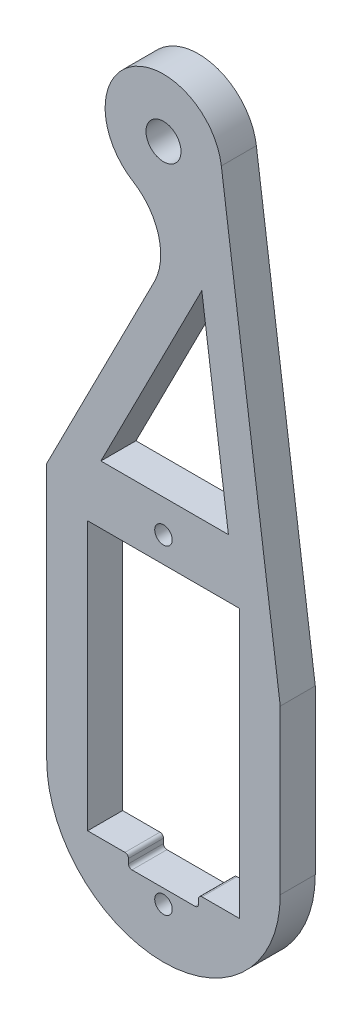
ISO-10303-21;
HEADER;
FILE_DESCRIPTION(('STEP AP214'),'2;1');
FILE_NAME('part.step','',(''),(''),'','','');
FILE_SCHEMA(('AUTOMOTIVE_DESIGN { 1 0 10303 214 1 1 1 1 }'));
ENDSEC;
DATA;
#1=APPLICATION_CONTEXT('core data for automotive mechanical design processes');
#2=APPLICATION_PROTOCOL_DEFINITION('international standard','automotive_design',2000,#1);
#3=PRODUCT_CONTEXT('',#1,'mechanical');
#4=PRODUCT('Part','Part','',(#3));
#5=PRODUCT_RELATED_PRODUCT_CATEGORY('part','',(#4));
#6=PRODUCT_DEFINITION_FORMATION('','',#4);
#7=PRODUCT_DEFINITION_CONTEXT('part definition',#1,'design');
#8=PRODUCT_DEFINITION('design','',#6,#7);
#9=PRODUCT_DEFINITION_SHAPE('','',#8);
#10=(LENGTH_UNIT() NAMED_UNIT(*) SI_UNIT(.MILLI.,.METRE.));
#11=(NAMED_UNIT(*) PLANE_ANGLE_UNIT() SI_UNIT($,.RADIAN.));
#12=(NAMED_UNIT(*) SI_UNIT($,.STERADIAN.) SOLID_ANGLE_UNIT());
#13=UNCERTAINTY_MEASURE_WITH_UNIT(LENGTH_MEASURE(1.E-05),#10,'distance_accuracy_value','');
#14=(GEOMETRIC_REPRESENTATION_CONTEXT(3) GLOBAL_UNCERTAINTY_ASSIGNED_CONTEXT((#13)) GLOBAL_UNIT_ASSIGNED_CONTEXT((#10,
#11,#12)) REPRESENTATION_CONTEXT('',''));
#15=CARTESIAN_POINT('',(0.,0.,0.));
#16=DIRECTION('',(0.,0.,1.));
#17=DIRECTION('',(1.,0.,0.));
#18=AXIS2_PLACEMENT_3D('',#15,#16,#17);
#19=CARTESIAN_POINT('',(0.,-11.5,1.5));
#20=DIRECTION('',(0.,1.,0.));
#21=DIRECTION('',(0.,0.,1.));
#22=AXIS2_PLACEMENT_3D('',#19,#20,#21);
#23=PLANE('',#22);
#24=DIRECTION('',(1.,0.,0.));
#25=VECTOR('',#24,1.);
#26=CARTESIAN_POINT('',(0.,-11.5,-1.5));
#27=LINE('',#26,#25);
#28=CARTESIAN_POINT('',(3.3,-11.5,-1.5));
#29=VERTEX_POINT('',#28);
#30=CARTESIAN_POINT('',(6.5,-11.5,-1.5));
#31=VERTEX_POINT('',#30);
#32=EDGE_CURVE('E315',#29,#31,#27,.T.);
#33=ORIENTED_EDGE('',*,*,#32,.F.);
#34=DIRECTION('',(0.,0.,1.));
#35=VECTOR('',#34,1.);
#36=CARTESIAN_POINT('',(3.3,-11.5,1.5));
#37=LINE('',#36,#35);
#38=CARTESIAN_POINT('',(3.3,-11.5,1.5));
#39=VERTEX_POINT('',#38);
#40=EDGE_CURVE('E398',#29,#39,#37,.T.);
#41=ORIENTED_EDGE('',*,*,#40,.T.);
#42=DIRECTION('',(1.,0.,0.));
#43=VECTOR('',#42,1.);
#44=CARTESIAN_POINT('',(0.,-11.5,1.5));
#45=LINE('',#44,#43);
#46=CARTESIAN_POINT('',(6.5,-11.5,1.5));
#47=VERTEX_POINT('',#46);
#48=EDGE_CURVE('E248',#39,#47,#45,.T.);
#49=ORIENTED_EDGE('',*,*,#48,.T.);
#50=DIRECTION('',(0.,0.,-1.));
#51=VECTOR('',#50,1.);
#52=CARTESIAN_POINT('',(6.5,-11.5,1.5));
#53=LINE('',#52,#51);
#54=EDGE_CURVE('E359',#47,#31,#53,.T.);
#55=ORIENTED_EDGE('',*,*,#54,.T.);
#56=EDGE_LOOP('',(#33,#41,#49,#55));
#57=FACE_BOUND('',#56,.T.);
#58=ADVANCED_FACE('F41',(#57),#23,.T.);
#59=CARTESIAN_POINT('',(0.,16.5,1.5));
#60=DIRECTION('',(0.,1.,0.));
#61=DIRECTION('',(0.,0.,1.));
#62=AXIS2_PLACEMENT_3D('',#59,#60,#61);
#63=PLANE('',#62);
#64=DIRECTION('',(1.,0.,0.));
#65=VECTOR('',#64,1.);
#66=CARTESIAN_POINT('',(0.,16.5,-1.5));
#67=LINE('',#66,#65);
#68=CARTESIAN_POINT('',(-5.35920766336086,16.5,-1.5));
#69=VERTEX_POINT('',#68);
#70=CARTESIAN_POINT('',(5.56229891618006,16.5,-1.5));
#71=VERTEX_POINT('',#70);
#72=EDGE_CURVE('E323',#69,#71,#67,.T.);
#73=ORIENTED_EDGE('',*,*,#72,.F.);
#74=DIRECTION('',(0.,0.,-1.));
#75=VECTOR('',#74,1.);
#76=CARTESIAN_POINT('',(-5.35920766336086,16.5,1.5));
#77=LINE('',#76,#75);
#78=CARTESIAN_POINT('',(-5.35920766336086,16.5,1.5));
#79=VERTEX_POINT('',#78);
#80=EDGE_CURVE('E350',#79,#69,#77,.T.);
#81=ORIENTED_EDGE('',*,*,#80,.F.);
#82=DIRECTION('',(1.,0.,0.));
#83=VECTOR('',#82,1.);
#84=CARTESIAN_POINT('',(0.,16.5,1.5));
#85=LINE('',#84,#83);
#86=CARTESIAN_POINT('',(5.56229891618006,16.5,1.5));
#87=VERTEX_POINT('',#86);
#88=EDGE_CURVE('E257',#79,#87,#85,.T.);
#89=ORIENTED_EDGE('',*,*,#88,.T.);
#90=DIRECTION('',(0.,0.,-1.));
#91=VECTOR('',#90,1.);
#92=CARTESIAN_POINT('',(5.56229891618006,16.5,1.5));
#93=LINE('',#92,#91);
#94=EDGE_CURVE('E343',#87,#71,#93,.T.);
#95=ORIENTED_EDGE('',*,*,#94,.T.);
#96=EDGE_LOOP('',(#73,#81,#89,#95));
#97=FACE_BOUND('',#96,.T.);
#98=ADVANCED_FACE('F487',(#97),#63,.T.);
#99=CARTESIAN_POINT('',(-10.9290256495219,5.56861670660875,1.5));
#100=DIRECTION('',(-0.891006524188369,0.453990499739544,0.));
#101=DIRECTION('',(-0.453990499739545,-0.891006524188369,0.));
#102=AXIS2_PLACEMENT_3D('',#99,#100,#101);
#103=PLANE('',#102);
#104=DIRECTION('',(0.453990499739544,0.891006524188369,0.));
#105=VECTOR('',#104,1.);
#106=CARTESIAN_POINT('',(-10.9290256495219,5.56861670660875,-1.5));
#107=LINE('',#106,#105);
#108=CARTESIAN_POINT('',(3.28334616685816,33.4619669415817,-1.5));
#109=VERTEX_POINT('',#108);
#110=EDGE_CURVE('E327',#69,#109,#107,.T.);
#111=ORIENTED_EDGE('',*,*,#110,.T.);
#112=DIRECTION('',(0.,0.,-1.));
#113=VECTOR('',#112,1.);
#114=CARTESIAN_POINT('',(3.28334616685816,33.4619669415817,1.5));
#115=LINE('',#114,#113);
#116=CARTESIAN_POINT('',(3.28334616685816,33.4619669415817,1.5));
#117=VERTEX_POINT('',#116);
#118=EDGE_CURVE('E346',#117,#109,#115,.T.);
#119=ORIENTED_EDGE('',*,*,#118,.F.);
#120=DIRECTION('',(0.453990499739544,0.891006524188369,0.));
#121=VECTOR('',#120,1.);
#122=CARTESIAN_POINT('',(-10.9290256495219,5.56861670660875,1.5));
#123=LINE('',#122,#121);
#124=EDGE_CURVE('E261',#79,#117,#123,.T.);
#125=ORIENTED_EDGE('',*,*,#124,.F.);
#126=ORIENTED_EDGE('',*,*,#80,.T.);
#127=EDGE_LOOP('',(#111,#119,#125,#126));
#128=FACE_BOUND('',#127,.T.);
#129=ADVANCED_FACE('F494',(#128),#103,.F.);
#130=CARTESIAN_POINT('',(0.,11.5,1.5));
#131=DIRECTION('',(0.,1.,0.));
#132=DIRECTION('',(0.,0.,1.));
#133=AXIS2_PLACEMENT_3D('',#130,#131,#132);
#134=PLANE('',#133);
#135=DIRECTION('',(1.,0.,0.));
#136=VECTOR('',#135,1.);
#137=CARTESIAN_POINT('',(0.,11.5,-1.5));
#138=LINE('',#137,#136);
#139=CARTESIAN_POINT('',(-6.5,11.5,-1.5));
#140=VERTEX_POINT('',#139);
#141=CARTESIAN_POINT('',(6.5,11.5,-1.5));
#142=VERTEX_POINT('',#141);
#143=EDGE_CURVE('E307',#140,#142,#138,.T.);
#144=ORIENTED_EDGE('',*,*,#143,.T.);
#145=DIRECTION('',(0.,0.,-1.));
#146=VECTOR('',#145,1.);
#147=CARTESIAN_POINT('',(6.5,11.5,1.5));
#148=LINE('',#147,#146);
#149=CARTESIAN_POINT('',(6.5,11.5,1.5));
#150=VERTEX_POINT('',#149);
#151=EDGE_CURVE('E347',#150,#142,#148,.T.);
#152=ORIENTED_EDGE('',*,*,#151,.F.);
#153=DIRECTION('',(1.,0.,0.));
#154=VECTOR('',#153,1.);
#155=CARTESIAN_POINT('',(0.,11.5,1.5));
#156=LINE('',#155,#154);
#157=CARTESIAN_POINT('',(-6.5,11.5,1.5));
#158=VERTEX_POINT('',#157);
#159=EDGE_CURVE('E240',#158,#150,#156,.T.);
#160=ORIENTED_EDGE('',*,*,#159,.F.);
#161=DIRECTION('',(0.,0.,-1.));
#162=VECTOR('',#161,1.);
#163=CARTESIAN_POINT('',(-6.5,11.5,1.5));
#164=LINE('',#163,#162);
#165=EDGE_CURVE('E203',#158,#140,#164,.T.);
#166=ORIENTED_EDGE('',*,*,#165,.T.);
#167=EDGE_LOOP('',(#144,#152,#160,#166));
#168=FACE_BOUND('',#167,.T.);
#169=ADVANCED_FACE('F508',(#168),#134,.F.);
#170=CARTESIAN_POINT('',(6.5,0.,1.5));
#171=DIRECTION('',(1.,0.,0.));
#172=DIRECTION('',(0.,1.,0.));
#173=AXIS2_PLACEMENT_3D('',#170,#171,#172);
#174=PLANE('',#173);
#175=DIRECTION('',(0.,-1.,0.));
#176=VECTOR('',#175,1.);
#177=CARTESIAN_POINT('',(6.5,0.,-1.5));
#178=LINE('',#177,#176);
#179=EDGE_CURVE('E311',#142,#31,#178,.T.);
#180=ORIENTED_EDGE('',*,*,#179,.T.);
#181=ORIENTED_EDGE('',*,*,#54,.F.);
#182=DIRECTION('',(0.,-1.,0.));
#183=VECTOR('',#182,1.);
#184=CARTESIAN_POINT('',(6.5,0.,1.5));
#185=LINE('',#184,#183);
#186=EDGE_CURVE('E244',#150,#47,#185,.T.);
#187=ORIENTED_EDGE('',*,*,#186,.F.);
#188=ORIENTED_EDGE('',*,*,#151,.T.);
#189=EDGE_LOOP('',(#180,#181,#187,#188));
#190=FACE_BOUND('',#189,.T.);
#191=ADVANCED_FACE('F501',(#190),#174,.F.);
#192=CARTESIAN_POINT('',(-6.5,-11.5,1.5));
#193=VERTEX_POINT('',#192);
#194=CARTESIAN_POINT('',(-3.3,-11.5,1.5));
#195=VERTEX_POINT('',#194);
#196=EDGE_CURVE('E249',#193,#195,#45,.T.);
#197=ORIENTED_EDGE('',*,*,#196,.T.);
#198=DIRECTION('',(0.,0.,1.));
#199=VECTOR('',#198,1.);
#200=CARTESIAN_POINT('',(-3.3,-11.5,-1.5));
#201=LINE('',#200,#199);
#202=CARTESIAN_POINT('',(-3.3,-11.5,-1.5));
#203=VERTEX_POINT('',#202);
#204=EDGE_CURVE('E419',#195,#203,#201,.F.);
#205=ORIENTED_EDGE('',*,*,#204,.T.);
#206=CARTESIAN_POINT('',(-6.5,-11.5,-1.5));
#207=VERTEX_POINT('',#206);
#208=EDGE_CURVE('E316',#207,#203,#27,.T.);
#209=ORIENTED_EDGE('',*,*,#208,.F.);
#210=DIRECTION('',(0.,0.,-1.));
#211=VECTOR('',#210,1.);
#212=CARTESIAN_POINT('',(-6.5,-11.5,1.5));
#213=LINE('',#212,#211);
#214=EDGE_CURVE('E356',#193,#207,#213,.T.);
#215=ORIENTED_EDGE('',*,*,#214,.F.);
#216=EDGE_LOOP('',(#197,#205,#209,#215));
#217=FACE_BOUND('',#216,.T.);
#218=ADVANCED_FACE('F490',(#217),#23,.T.);
#219=CARTESIAN_POINT('',(-5.23715044284418,34.361064899941,1.5));
#220=DIRECTION('',(0.,0.,-1.));
#221=DIRECTION('',(-1.,0.,0.));
#222=AXIS2_PLACEMENT_3D('',#219,#220,#221);
#223=CYLINDRICAL_SURFACE('',#222,5.);
#224=CARTESIAN_POINT('',(-5.23715044284418,34.361064899941,-1.5));
#225=DIRECTION('',(0.,0.,1.));
#226=DIRECTION('',(1.,0.,0.));
#227=AXIS2_PLACEMENT_3D('',#224,#225,#226);
#228=CIRCLE('',#227,5.);
#229=CARTESIAN_POINT('',(-0.78211782190234,32.0911124012433,-1.5));
#230=VERTEX_POINT('',#229);
#231=CARTESIAN_POINT('',(-2.61857522142209,38.6205324499705,-1.5));
#232=VERTEX_POINT('',#231);
#233=EDGE_CURVE('E197',#230,#232,#228,.T.);
#234=ORIENTED_EDGE('',*,*,#233,.F.);
#235=DIRECTION('',(0.,0.,-1.));
#236=VECTOR('',#235,1.);
#237=CARTESIAN_POINT('',(-0.78211782190234,32.0911124012433,1.5));
#238=LINE('',#237,#236);
#239=CARTESIAN_POINT('',(-0.78211782190234,32.0911124012433,1.5));
#240=VERTEX_POINT('',#239);
#241=EDGE_CURVE('E192',#240,#230,#238,.T.);
#242=ORIENTED_EDGE('',*,*,#241,.F.);
#243=CARTESIAN_POINT('',(-5.23715044284418,34.361064899941,1.5));
#244=DIRECTION('',(0.,0.,1.));
#245=DIRECTION('',(1.,0.,0.));
#246=AXIS2_PLACEMENT_3D('',#243,#244,#245);
#247=CIRCLE('',#246,5.);
#248=CARTESIAN_POINT('',(-2.61857522142209,38.6205324499705,1.5));
#249=VERTEX_POINT('',#248);
#250=EDGE_CURVE('E195',#240,#249,#247,.T.);
#251=ORIENTED_EDGE('',*,*,#250,.T.);
#252=DIRECTION('',(0.,0.,-1.));
#253=VECTOR('',#252,1.);
#254=CARTESIAN_POINT('',(-2.61857522142209,38.6205324499705,1.5));
#255=LINE('',#254,#253);
#256=EDGE_CURVE('E276',#249,#232,#255,.T.);
#257=ORIENTED_EDGE('',*,*,#256,.T.);
#258=EDGE_LOOP('',(#234,#242,#251,#257));
#259=FACE_BOUND('',#258,.T.);
#260=ADVANCED_FACE('F194',(#259),#223,.F.);
#261=CARTESIAN_POINT('',(-13.602045222087,6.93058820582737,1.5));
#262=DIRECTION('',(-0.891006524188369,0.453990499739544,0.));
#263=DIRECTION('',(-0.453990499739544,-0.891006524188369,0.));
#264=AXIS2_PLACEMENT_3D('',#261,#262,#263);
#265=PLANE('',#264);
#266=DIRECTION('',(0.453990499739544,0.891006524188369,0.));
#267=VECTOR('',#266,1.);
#268=CARTESIAN_POINT('',(-13.602045222087,6.93058820582737,-1.5));
#269=LINE('',#268,#267);
#270=CARTESIAN_POINT('',(-10.,14.,-1.5));
#271=VERTEX_POINT('',#270);
#272=EDGE_CURVE('E284',#271,#230,#269,.T.);
#273=ORIENTED_EDGE('',*,*,#272,.F.);
#274=DIRECTION('',(0.,0.,-1.));
#275=VECTOR('',#274,1.);
#276=CARTESIAN_POINT('',(-10.,14.,1.5));
#277=LINE('',#276,#275);
#278=CARTESIAN_POINT('',(-10.,14.,1.5));
#279=VERTEX_POINT('',#278);
#280=EDGE_CURVE('E204',#279,#271,#277,.T.);
#281=ORIENTED_EDGE('',*,*,#280,.F.);
#282=DIRECTION('',(0.453990499739544,0.891006524188369,0.));
#283=VECTOR('',#282,1.);
#284=CARTESIAN_POINT('',(-13.602045222087,6.93058820582737,1.5));
#285=LINE('',#284,#283);
#286=EDGE_CURVE('E211',#279,#240,#285,.T.);
#287=ORIENTED_EDGE('',*,*,#286,.T.);
#288=ORIENTED_EDGE('',*,*,#241,.T.);
#289=EDGE_LOOP('',(#273,#281,#287,#288));
#290=FACE_BOUND('',#289,.T.);
#291=ADVANCED_FACE('F219',(#290),#265,.T.);
#292=CARTESIAN_POINT('',(-10.,0.,1.5));
#293=DIRECTION('',(-1.,0.,0.));
#294=DIRECTION('',(0.,-1.,0.));
#295=AXIS2_PLACEMENT_3D('',#292,#293,#294);
#296=PLANE('',#295);
#297=DIRECTION('',(0.,1.,0.));
#298=VECTOR('',#297,1.);
#299=CARTESIAN_POINT('',(-10.,0.,-1.5));
#300=LINE('',#299,#298);
#301=CARTESIAN_POINT('',(-10.,-8.,-1.5));
#302=VERTEX_POINT('',#301);
#303=EDGE_CURVE('E287',#302,#271,#300,.T.);
#304=ORIENTED_EDGE('',*,*,#303,.F.);
#305=DIRECTION('',(0.,0.,-1.));
#306=VECTOR('',#305,1.);
#307=CARTESIAN_POINT('',(-10.,-8.,1.5));
#308=LINE('',#307,#306);
#309=CARTESIAN_POINT('',(-10.,-8.,1.5));
#310=VERTEX_POINT('',#309);
#311=EDGE_CURVE('E380',#310,#302,#308,.T.);
#312=ORIENTED_EDGE('',*,*,#311,.F.);
#313=DIRECTION('',(0.,1.,0.));
#314=VECTOR('',#313,1.);
#315=CARTESIAN_POINT('',(-10.,0.,1.5));
#316=LINE('',#315,#314);
#317=EDGE_CURVE('E221',#310,#279,#316,.T.);
#318=ORIENTED_EDGE('',*,*,#317,.T.);
#319=ORIENTED_EDGE('',*,*,#280,.T.);
#320=EDGE_LOOP('',(#304,#312,#318,#319));
#321=FACE_BOUND('',#320,.T.);
#322=ADVANCED_FACE('F535',(#321),#296,.T.);
#323=CARTESIAN_POINT('',(0.,-8.,1.5));
#324=DIRECTION('',(0.,0.,-1.));
#325=DIRECTION('',(-1.,0.,0.));
#326=AXIS2_PLACEMENT_3D('',#323,#324,#325);
#327=CYLINDRICAL_SURFACE('',#326,10.);
#328=CARTESIAN_POINT('',(0.,-8.,-1.5));
#329=DIRECTION('',(0.,0.,1.));
#330=DIRECTION('',(1.,0.,0.));
#331=AXIS2_PLACEMENT_3D('',#328,#329,#330);
#332=CIRCLE('',#331,10.);
#333=CARTESIAN_POINT('',(10.,-8.,-1.5));
#334=VERTEX_POINT('',#333);
#335=EDGE_CURVE('E291',#302,#334,#332,.T.);
#336=ORIENTED_EDGE('',*,*,#335,.T.);
#337=DIRECTION('',(0.,0.,-1.));
#338=VECTOR('',#337,1.);
#339=CARTESIAN_POINT('',(10.,-8.,1.5));
#340=LINE('',#339,#338);
#341=CARTESIAN_POINT('',(10.,-8.,1.5));
#342=VERTEX_POINT('',#341);
#343=EDGE_CURVE('E376',#342,#334,#340,.T.);
#344=ORIENTED_EDGE('',*,*,#343,.F.);
#345=CARTESIAN_POINT('',(0.,-8.,1.5));
#346=DIRECTION('',(0.,0.,1.));
#347=DIRECTION('',(1.,0.,0.));
#348=AXIS2_PLACEMENT_3D('',#345,#346,#347);
#349=CIRCLE('',#348,10.);
#350=EDGE_CURVE('E224',#310,#342,#349,.T.);
#351=ORIENTED_EDGE('',*,*,#350,.F.);
#352=ORIENTED_EDGE('',*,*,#311,.T.);
#353=EDGE_LOOP('',(#336,#344,#351,#352));
#354=FACE_BOUND('',#353,.T.);
#355=ADVANCED_FACE('F538',(#354),#327,.T.);
#356=CARTESIAN_POINT('',(10.,0.,1.5));
#357=DIRECTION('',(-1.,0.,0.));
#358=DIRECTION('',(0.,-1.,0.));
#359=AXIS2_PLACEMENT_3D('',#356,#357,#358);
#360=PLANE('',#359);
#361=DIRECTION('',(0.,1.,0.));
#362=VECTOR('',#361,1.);
#363=CARTESIAN_POINT('',(10.,0.,-1.5));
#364=LINE('',#363,#362);
#365=CARTESIAN_POINT('',(10.,6.,-1.5));
#366=VERTEX_POINT('',#365);
#367=EDGE_CURVE('E295',#334,#366,#364,.T.);
#368=ORIENTED_EDGE('',*,*,#367,.T.);
#369=DIRECTION('',(0.,0.,-1.));
#370=VECTOR('',#369,1.);
#371=CARTESIAN_POINT('',(10.,6.,1.5));
#372=LINE('',#371,#370);
#373=CARTESIAN_POINT('',(10.,6.,1.5));
#374=VERTEX_POINT('',#373);
#375=EDGE_CURVE('E372',#374,#366,#372,.T.);
#376=ORIENTED_EDGE('',*,*,#375,.F.);
#377=DIRECTION('',(0.,1.,0.));
#378=VECTOR('',#377,1.);
#379=CARTESIAN_POINT('',(10.,0.,1.5));
#380=LINE('',#379,#378);
#381=EDGE_CURVE('E231',#342,#374,#380,.T.);
#382=ORIENTED_EDGE('',*,*,#381,.F.);
#383=ORIENTED_EDGE('',*,*,#343,.T.);
#384=EDGE_LOOP('',(#368,#376,#382,#383));
#385=FACE_BOUND('',#384,.T.);
#386=ADVANCED_FACE('F542',(#385),#360,.F.);
#387=CARTESIAN_POINT('',(10.6145294422461,1.42613242547147,1.5));
#388=DIRECTION('',(-0.991094537062106,-0.133160123932241,0.));
#389=DIRECTION('',(0.133160123932241,-0.991094537062106,0.));
#390=AXIS2_PLACEMENT_3D('',#387,#388,#389);
#391=PLANE('',#390);
#392=DIRECTION('',(-0.133160123932241,0.991094537062106,0.));
#393=VECTOR('',#392,1.);
#394=CARTESIAN_POINT('',(10.6145294422461,1.42613242547147,-1.5));
#395=LINE('',#394,#393);
#396=CARTESIAN_POINT('',(4.95547268531053,43.5458006196612,-1.5));
#397=VERTEX_POINT('',#396);
#398=EDGE_CURVE('E299',#366,#397,#395,.T.);
#399=ORIENTED_EDGE('',*,*,#398,.T.);
#400=DIRECTION('',(0.,0.,-1.));
#401=VECTOR('',#400,1.);
#402=CARTESIAN_POINT('',(4.95547268531053,43.5458006196612,1.5));
#403=LINE('',#402,#401);
#404=CARTESIAN_POINT('',(4.95547268531053,43.5458006196612,1.5));
#405=VERTEX_POINT('',#404);
#406=EDGE_CURVE('E368',#405,#397,#403,.T.);
#407=ORIENTED_EDGE('',*,*,#406,.F.);
#408=DIRECTION('',(-0.133160123932241,0.991094537062106,0.));
#409=VECTOR('',#408,1.);
#410=CARTESIAN_POINT('',(10.6145294422461,1.42613242547147,1.5));
#411=LINE('',#410,#409);
#412=EDGE_CURVE('E235',#374,#405,#411,.T.);
#413=ORIENTED_EDGE('',*,*,#412,.F.);
#414=ORIENTED_EDGE('',*,*,#375,.T.);
#415=EDGE_LOOP('',(#399,#407,#413,#414));
#416=FACE_BOUND('',#415,.T.);
#417=ADVANCED_FACE('F546',(#416),#391,.F.);
#418=CARTESIAN_POINT('',(0.,13.7,1.5));
#419=DIRECTION('',(0.,0.,-1.));
#420=DIRECTION('',(-1.,0.,0.));
#421=AXIS2_PLACEMENT_3D('',#418,#419,#420);
#422=CYLINDRICAL_SURFACE('',#421,0.75);
#423=CARTESIAN_POINT('',(0.,13.7,1.5));
#424=DIRECTION('',(0.,0.,1.));
#425=DIRECTION('',(1.,0.,0.));
#426=AXIS2_PLACEMENT_3D('',#423,#424,#425);
#427=CIRCLE('',#426,0.75);
#428=CARTESIAN_POINT('',(0.75,13.7,1.5));
#429=VERTEX_POINT('',#428);
#430=EDGE_CURVE('E268',#429,#429,#427,.T.);
#431=ORIENTED_EDGE('',*,*,#430,.T.);
#432=EDGE_LOOP('',(#431));
#433=FACE_BOUND('',#432,.T.);
#434=CARTESIAN_POINT('',(0.,13.7,-1.5));
#435=DIRECTION('',(0.,0.,1.));
#436=DIRECTION('',(1.,0.,0.));
#437=AXIS2_PLACEMENT_3D('',#434,#435,#436);
#438=CIRCLE('',#437,0.75);
#439=CARTESIAN_POINT('',(0.75,13.7,-1.5));
#440=VERTEX_POINT('',#439);
#441=EDGE_CURVE('E335',#440,#440,#438,.T.);
#442=ORIENTED_EDGE('',*,*,#441,.F.);
#443=EDGE_LOOP('',(#442));
#444=FACE_BOUND('',#443,.T.);
#445=ADVANCED_FACE('F550',(#433,#444),#422,.F.);
#446=CARTESIAN_POINT('',(7.64124583105973,1.02665205367475,1.5));
#447=DIRECTION('',(-0.991094537062106,-0.133160123932241,0.));
#448=DIRECTION('',(0.133160123932241,-0.991094537062106,0.));
#449=AXIS2_PLACEMENT_3D('',#446,#447,#448);
#450=PLANE('',#449);
#451=DIRECTION('',(-0.133160123932241,0.991094537062106,0.));
#452=VECTOR('',#451,1.);
#453=CARTESIAN_POINT('',(7.64124583105973,1.02665205367475,-1.5));
#454=LINE('',#453,#452);
#455=EDGE_CURVE('E331',#71,#109,#454,.T.);
#456=ORIENTED_EDGE('',*,*,#455,.F.);
#457=ORIENTED_EDGE('',*,*,#94,.F.);
#458=DIRECTION('',(-0.133160123932241,0.991094537062106,0.));
#459=VECTOR('',#458,1.);
#460=CARTESIAN_POINT('',(7.64124583105973,1.02665205367475,1.5));
#461=LINE('',#460,#459);
#462=EDGE_CURVE('E264',#87,#117,#461,.T.);
#463=ORIENTED_EDGE('',*,*,#462,.T.);
#464=ORIENTED_EDGE('',*,*,#118,.T.);
#465=EDGE_LOOP('',(#456,#457,#463,#464));
#466=FACE_BOUND('',#465,.T.);
#467=ADVANCED_FACE('F655',(#466),#450,.T.);
#468=CARTESIAN_POINT('',(-6.5,0.,1.5));
#469=DIRECTION('',(1.,0.,0.));
#470=DIRECTION('',(0.,1.,0.));
#471=AXIS2_PLACEMENT_3D('',#468,#469,#470);
#472=PLANE('',#471);
#473=DIRECTION('',(0.,-1.,0.));
#474=VECTOR('',#473,1.);
#475=CARTESIAN_POINT('',(-6.5,0.,-1.5));
#476=LINE('',#475,#474);
#477=EDGE_CURVE('E319',#140,#207,#476,.T.);
#478=ORIENTED_EDGE('',*,*,#477,.F.);
#479=ORIENTED_EDGE('',*,*,#165,.F.);
#480=DIRECTION('',(0.,-1.,0.));
#481=VECTOR('',#480,1.);
#482=CARTESIAN_POINT('',(-6.5,0.,1.5));
#483=LINE('',#482,#481);
#484=EDGE_CURVE('E253',#158,#193,#483,.T.);
#485=ORIENTED_EDGE('',*,*,#484,.T.);
#486=ORIENTED_EDGE('',*,*,#214,.T.);
#487=EDGE_LOOP('',(#478,#479,#485,#486));
#488=FACE_BOUND('',#487,.T.);
#489=ADVANCED_FACE('F554',(#488),#472,.T.);
#490=CARTESIAN_POINT('',(0.,42.88,1.5));
#491=DIRECTION('',(0.,0.,-1.));
#492=DIRECTION('',(-1.,0.,0.));
#493=AXIS2_PLACEMENT_3D('',#490,#491,#492);
#494=CYLINDRICAL_SURFACE('',#493,5.);
#495=CARTESIAN_POINT('',(0.,42.88,-1.5));
#496=DIRECTION('',(0.,0.,1.));
#497=DIRECTION('',(1.,0.,0.));
#498=AXIS2_PLACEMENT_3D('',#495,#496,#497);
#499=CIRCLE('',#498,5.);
#500=EDGE_CURVE('E303',#397,#232,#499,.T.);
#501=ORIENTED_EDGE('',*,*,#500,.T.);
#502=ORIENTED_EDGE('',*,*,#256,.F.);
#503=CARTESIAN_POINT('',(0.,42.88,1.5));
#504=DIRECTION('',(0.,0.,1.));
#505=DIRECTION('',(1.,0.,0.));
#506=AXIS2_PLACEMENT_3D('',#503,#504,#505);
#507=CIRCLE('',#506,5.);
#508=EDGE_CURVE('E214',#405,#249,#507,.T.);
#509=ORIENTED_EDGE('',*,*,#508,.F.);
#510=ORIENTED_EDGE('',*,*,#406,.T.);
#511=EDGE_LOOP('',(#501,#502,#509,#510));
#512=FACE_BOUND('',#511,.T.);
#513=ADVANCED_FACE('F531',(#512),#494,.T.);
#514=CARTESIAN_POINT('',(0.,42.88,1.5));
#515=DIRECTION('',(0.,0.,-1.));
#516=DIRECTION('',(-1.,0.,0.));
#517=AXIS2_PLACEMENT_3D('',#514,#515,#516);
#518=CYLINDRICAL_SURFACE('',#517,1.5);
#519=CARTESIAN_POINT('',(0.,42.88,1.5));
#520=DIRECTION('',(0.,0.,1.));
#521=DIRECTION('',(1.,0.,0.));
#522=AXIS2_PLACEMENT_3D('',#519,#520,#521);
#523=CIRCLE('',#522,1.5);
#524=CARTESIAN_POINT('',(1.5,42.88,1.5));
#525=VERTEX_POINT('',#524);
#526=EDGE_CURVE('E217',#525,#525,#523,.T.);
#527=ORIENTED_EDGE('',*,*,#526,.T.);
#528=EDGE_LOOP('',(#527));
#529=FACE_BOUND('',#528,.T.);
#530=CARTESIAN_POINT('',(0.,42.88,-1.5));
#531=DIRECTION('',(0.,0.,1.));
#532=DIRECTION('',(1.,0.,0.));
#533=AXIS2_PLACEMENT_3D('',#530,#531,#532);
#534=CIRCLE('',#533,1.5);
#535=CARTESIAN_POINT('',(1.5,42.88,-1.5));
#536=VERTEX_POINT('',#535);
#537=EDGE_CURVE('E277',#536,#536,#534,.T.);
#538=ORIENTED_EDGE('',*,*,#537,.F.);
#539=EDGE_LOOP('',(#538));
#540=FACE_BOUND('',#539,.T.);
#541=ADVANCED_FACE('F471',(#529,#540),#518,.F.);
#542=CARTESIAN_POINT('',(0.,-13.7,1.5));
#543=DIRECTION('',(0.,0.,-1.));
#544=DIRECTION('',(-1.,0.,0.));
#545=AXIS2_PLACEMENT_3D('',#542,#543,#544);
#546=CYLINDRICAL_SURFACE('',#545,0.75);
#547=CARTESIAN_POINT('',(0.,-13.7,1.5));
#548=DIRECTION('',(0.,0.,1.));
#549=DIRECTION('',(1.,0.,0.));
#550=AXIS2_PLACEMENT_3D('',#547,#548,#549);
#551=CIRCLE('',#550,0.75);
#552=CARTESIAN_POINT('',(0.75,-13.7,1.5));
#553=VERTEX_POINT('',#552);
#554=EDGE_CURVE('E272',#553,#553,#551,.F.);
#555=ORIENTED_EDGE('',*,*,#554,.F.);
#556=EDGE_LOOP('',(#555));
#557=FACE_BOUND('',#556,.T.);
#558=CARTESIAN_POINT('',(0.,-13.7,-1.5));
#559=DIRECTION('',(0.,0.,1.));
#560=DIRECTION('',(1.,0.,0.));
#561=AXIS2_PLACEMENT_3D('',#558,#559,#560);
#562=CIRCLE('',#561,0.75);
#563=CARTESIAN_POINT('',(0.75,-13.7,-1.5));
#564=VERTEX_POINT('',#563);
#565=EDGE_CURVE('E339',#564,#564,#562,.F.);
#566=ORIENTED_EDGE('',*,*,#565,.T.);
#567=EDGE_LOOP('',(#566));
#568=FACE_BOUND('',#567,.T.);
#569=ADVANCED_FACE('F474',(#557,#568),#546,.F.);
#570=CARTESIAN_POINT('',(0.,0.,1.5));
#571=DIRECTION('',(0.,0.,1.));
#572=DIRECTION('',(1.,0.,0.));
#573=AXIS2_PLACEMENT_3D('',#570,#571,#572);
#574=PLANE('',#573);
#575=ORIENTED_EDGE('',*,*,#48,.F.);
#576=CARTESIAN_POINT('',(3.3,-11.8,1.5));
#577=DIRECTION('',(0.,0.,1.));
#578=DIRECTION('',(1.,0.,0.));
#579=AXIS2_PLACEMENT_3D('',#576,#577,#578);
#580=CIRCLE('',#579,0.3);
#581=CARTESIAN_POINT('',(3.,-11.8,1.5));
#582=VERTEX_POINT('',#581);
#583=EDGE_CURVE('E405',#39,#582,#580,.T.);
#584=ORIENTED_EDGE('',*,*,#583,.T.);
#585=DIRECTION('',(0.,1.,0.));
#586=VECTOR('',#585,1.);
#587=CARTESIAN_POINT('',(3.,-12.5,1.5));
#588=LINE('',#587,#586);
#589=CARTESIAN_POINT('',(3.,-12.2,1.5));
#590=VERTEX_POINT('',#589);
#591=EDGE_CURVE('E460',#590,#582,#588,.T.);
#592=ORIENTED_EDGE('',*,*,#591,.F.);
#593=CARTESIAN_POINT('',(2.7,-12.2,1.5));
#594=DIRECTION('',(0.,0.,1.));
#595=DIRECTION('',(1.,0.,0.));
#596=AXIS2_PLACEMENT_3D('',#593,#594,#595);
#597=CIRCLE('',#596,0.3);
#598=CARTESIAN_POINT('',(2.7,-12.5,1.5));
#599=VERTEX_POINT('',#598);
#600=EDGE_CURVE('E422',#590,#599,#597,.F.);
#601=ORIENTED_EDGE('',*,*,#600,.T.);
#602=DIRECTION('',(1.,0.,0.));
#603=VECTOR('',#602,1.);
#604=CARTESIAN_POINT('',(-3.,-12.5,1.5));
#605=LINE('',#604,#603);
#606=CARTESIAN_POINT('',(-2.7,-12.5,1.5));
#607=VERTEX_POINT('',#606);
#608=EDGE_CURVE('E435',#607,#599,#605,.T.);
#609=ORIENTED_EDGE('',*,*,#608,.F.);
#610=CARTESIAN_POINT('',(-2.7,-12.2,1.5));
#611=DIRECTION('',(0.,0.,1.));
#612=DIRECTION('',(1.,0.,0.));
#613=AXIS2_PLACEMENT_3D('',#610,#611,#612);
#614=CIRCLE('',#613,0.3);
#615=CARTESIAN_POINT('',(-3.,-12.2,1.5));
#616=VERTEX_POINT('',#615);
#617=EDGE_CURVE('E50',#607,#616,#614,.F.);
#618=ORIENTED_EDGE('',*,*,#617,.T.);
#619=DIRECTION('',(0.,-1.,0.));
#620=VECTOR('',#619,1.);
#621=CARTESIAN_POINT('',(-3.,-11.5,1.5));
#622=LINE('',#621,#620);
#623=CARTESIAN_POINT('',(-3.,-11.8,1.5));
#624=VERTEX_POINT('',#623);
#625=EDGE_CURVE('E433',#624,#616,#622,.T.);
#626=ORIENTED_EDGE('',*,*,#625,.F.);
#627=CARTESIAN_POINT('',(-3.3,-11.8,1.5));
#628=DIRECTION('',(0.,0.,1.));
#629=DIRECTION('',(1.,0.,0.));
#630=AXIS2_PLACEMENT_3D('',#627,#628,#629);
#631=CIRCLE('',#630,0.3);
#632=EDGE_CURVE('E402',#624,#195,#631,.T.);
#633=ORIENTED_EDGE('',*,*,#632,.T.);
#634=ORIENTED_EDGE('',*,*,#196,.F.);
#635=ORIENTED_EDGE('',*,*,#484,.F.);
#636=ORIENTED_EDGE('',*,*,#159,.T.);
#637=ORIENTED_EDGE('',*,*,#186,.T.);
#638=EDGE_LOOP('',(#575,#584,#592,#601,#609,#618,#626,#633,#634,#635,#636,#637));
#639=FACE_BOUND('',#638,.T.);
#640=ORIENTED_EDGE('',*,*,#526,.F.);
#641=EDGE_LOOP('',(#640));
#642=FACE_BOUND('',#641,.T.);
#643=ORIENTED_EDGE('',*,*,#250,.F.);
#644=ORIENTED_EDGE('',*,*,#286,.F.);
#645=ORIENTED_EDGE('',*,*,#317,.F.);
#646=ORIENTED_EDGE('',*,*,#350,.T.);
#647=ORIENTED_EDGE('',*,*,#381,.T.);
#648=ORIENTED_EDGE('',*,*,#412,.T.);
#649=ORIENTED_EDGE('',*,*,#508,.T.);
#650=EDGE_LOOP('',(#643,#644,#645,#646,#647,#648,#649));
#651=FACE_BOUND('',#650,.T.);
#652=ORIENTED_EDGE('',*,*,#88,.F.);
#653=ORIENTED_EDGE('',*,*,#124,.T.);
#654=ORIENTED_EDGE('',*,*,#462,.F.);
#655=EDGE_LOOP('',(#652,#653,#654));
#656=FACE_BOUND('',#655,.T.);
#657=ORIENTED_EDGE('',*,*,#430,.F.);
#658=EDGE_LOOP('',(#657));
#659=FACE_BOUND('',#658,.T.);
#660=ORIENTED_EDGE('',*,*,#554,.T.);
#661=EDGE_LOOP('',(#660));
#662=FACE_BOUND('',#661,.T.);
#663=ADVANCED_FACE('F208',(#639,#642,#651,#656,#659,#662),#574,.T.);
#664=CARTESIAN_POINT('',(0.,0.,-1.5));
#665=DIRECTION('',(0.,0.,1.));
#666=DIRECTION('',(1.,0.,0.));
#667=AXIS2_PLACEMENT_3D('',#664,#665,#666);
#668=PLANE('',#667);
#669=ORIENTED_EDGE('',*,*,#537,.T.);
#670=EDGE_LOOP('',(#669));
#671=FACE_BOUND('',#670,.T.);
#672=ORIENTED_EDGE('',*,*,#233,.T.);
#673=ORIENTED_EDGE('',*,*,#500,.F.);
#674=ORIENTED_EDGE('',*,*,#398,.F.);
#675=ORIENTED_EDGE('',*,*,#367,.F.);
#676=ORIENTED_EDGE('',*,*,#335,.F.);
#677=ORIENTED_EDGE('',*,*,#303,.T.);
#678=ORIENTED_EDGE('',*,*,#272,.T.);
#679=EDGE_LOOP('',(#672,#673,#674,#675,#676,#677,#678));
#680=FACE_BOUND('',#679,.T.);
#681=DIRECTION('',(0.,1.,0.));
#682=VECTOR('',#681,1.);
#683=CARTESIAN_POINT('',(3.,-12.5,-1.5));
#684=LINE('',#683,#682);
#685=CARTESIAN_POINT('',(3.,-12.2,-1.5));
#686=VERTEX_POINT('',#685);
#687=CARTESIAN_POINT('',(3.,-11.8,-1.5));
#688=VERTEX_POINT('',#687);
#689=EDGE_CURVE('E281',#686,#688,#684,.T.);
#690=ORIENTED_EDGE('',*,*,#689,.T.);
#691=CARTESIAN_POINT('',(3.3,-11.8,-1.5));
#692=DIRECTION('',(0.,0.,1.));
#693=DIRECTION('',(1.,0.,0.));
#694=AXIS2_PLACEMENT_3D('',#691,#692,#693);
#695=CIRCLE('',#694,0.3);
#696=EDGE_CURVE('E410',#688,#29,#695,.F.);
#697=ORIENTED_EDGE('',*,*,#696,.T.);
#698=ORIENTED_EDGE('',*,*,#32,.T.);
#699=ORIENTED_EDGE('',*,*,#179,.F.);
#700=ORIENTED_EDGE('',*,*,#143,.F.);
#701=ORIENTED_EDGE('',*,*,#477,.T.);
#702=ORIENTED_EDGE('',*,*,#208,.T.);
#703=CARTESIAN_POINT('',(-3.3,-11.8,-1.5));
#704=DIRECTION('',(0.,0.,1.));
#705=DIRECTION('',(1.,0.,0.));
#706=AXIS2_PLACEMENT_3D('',#703,#704,#705);
#707=CIRCLE('',#706,0.3);
#708=CARTESIAN_POINT('',(-3.,-11.8,-1.5));
#709=VERTEX_POINT('',#708);
#710=EDGE_CURVE('E64',#203,#709,#707,.F.);
#711=ORIENTED_EDGE('',*,*,#710,.T.);
#712=DIRECTION('',(0.,-1.,0.));
#713=VECTOR('',#712,1.);
#714=CARTESIAN_POINT('',(-3.,-11.5,-1.5));
#715=LINE('',#714,#713);
#716=CARTESIAN_POINT('',(-3.,-12.2,-1.5));
#717=VERTEX_POINT('',#716);
#718=EDGE_CURVE('E451',#709,#717,#715,.T.);
#719=ORIENTED_EDGE('',*,*,#718,.T.);
#720=CARTESIAN_POINT('',(-2.7,-12.2,-1.5));
#721=DIRECTION('',(0.,0.,1.));
#722=DIRECTION('',(1.,0.,0.));
#723=AXIS2_PLACEMENT_3D('',#720,#721,#722);
#724=CIRCLE('',#723,0.3);
#725=CARTESIAN_POINT('',(-2.7,-12.5,-1.5));
#726=VERTEX_POINT('',#725);
#727=EDGE_CURVE('E11',#717,#726,#724,.T.);
#728=ORIENTED_EDGE('',*,*,#727,.T.);
#729=DIRECTION('',(1.,0.,0.));
#730=VECTOR('',#729,1.);
#731=CARTESIAN_POINT('',(-3.,-12.5,-1.5));
#732=LINE('',#731,#730);
#733=CARTESIAN_POINT('',(2.7,-12.5,-1.5));
#734=VERTEX_POINT('',#733);
#735=EDGE_CURVE('E449',#726,#734,#732,.T.);
#736=ORIENTED_EDGE('',*,*,#735,.T.);
#737=CARTESIAN_POINT('',(2.7,-12.2,-1.5));
#738=DIRECTION('',(0.,0.,1.));
#739=DIRECTION('',(1.,0.,0.));
#740=AXIS2_PLACEMENT_3D('',#737,#738,#739);
#741=CIRCLE('',#740,0.3);
#742=EDGE_CURVE('E425',#734,#686,#741,.T.);
#743=ORIENTED_EDGE('',*,*,#742,.T.);
#744=EDGE_LOOP('',(#690,#697,#698,#699,#700,#701,#702,#711,#719,#728,#736,#743));
#745=FACE_BOUND('',#744,.T.);
#746=ORIENTED_EDGE('',*,*,#72,.T.);
#747=ORIENTED_EDGE('',*,*,#455,.T.);
#748=ORIENTED_EDGE('',*,*,#110,.F.);
#749=EDGE_LOOP('',(#746,#747,#748));
#750=FACE_BOUND('',#749,.T.);
#751=ORIENTED_EDGE('',*,*,#441,.T.);
#752=EDGE_LOOP('',(#751));
#753=FACE_BOUND('',#752,.T.);
#754=ORIENTED_EDGE('',*,*,#565,.F.);
#755=EDGE_LOOP('',(#754));
#756=FACE_BOUND('',#755,.T.);
#757=ADVANCED_FACE('F447',(#671,#680,#745,#750,#753,#756),#668,.F.);
#758=CARTESIAN_POINT('',(3.,-12.5,-1.5));
#759=DIRECTION('',(1.,0.,0.));
#760=DIRECTION('',(0.,0.,-1.));
#761=AXIS2_PLACEMENT_3D('',#758,#759,#760);
#762=PLANE('',#761);
#763=ORIENTED_EDGE('',*,*,#689,.F.);
#764=DIRECTION('',(0.,0.,1.));
#765=VECTOR('',#764,1.);
#766=CARTESIAN_POINT('',(3.,-12.2,1.5));
#767=LINE('',#766,#765);
#768=EDGE_CURVE('E387',#686,#590,#767,.T.);
#769=ORIENTED_EDGE('',*,*,#768,.T.);
#770=ORIENTED_EDGE('',*,*,#591,.T.);
#771=DIRECTION('',(0.,0.,1.));
#772=VECTOR('',#771,1.);
#773=CARTESIAN_POINT('',(3.,-11.8,-1.5));
#774=LINE('',#773,#772);
#775=EDGE_CURVE('E353',#582,#688,#774,.F.);
#776=ORIENTED_EDGE('',*,*,#775,.T.);
#777=EDGE_LOOP('',(#763,#769,#770,#776));
#778=FACE_BOUND('',#777,.T.);
#779=ADVANCED_FACE('F480',(#778),#762,.F.);
#780=CARTESIAN_POINT('',(-3.,-12.5,-1.5));
#781=DIRECTION('',(0.,-1.,0.));
#782=DIRECTION('',(0.,0.,-1.));
#783=AXIS2_PLACEMENT_3D('',#780,#781,#782);
#784=PLANE('',#783);
#785=ORIENTED_EDGE('',*,*,#608,.T.);
#786=DIRECTION('',(0.,0.,1.));
#787=VECTOR('',#786,1.);
#788=CARTESIAN_POINT('',(2.7,-12.5,-1.5));
#789=LINE('',#788,#787);
#790=EDGE_CURVE('E395',#599,#734,#789,.F.);
#791=ORIENTED_EDGE('',*,*,#790,.T.);
#792=ORIENTED_EDGE('',*,*,#735,.F.);
#793=DIRECTION('',(0.,0.,1.));
#794=VECTOR('',#793,1.);
#795=CARTESIAN_POINT('',(-2.7,-12.5,1.5));
#796=LINE('',#795,#794);
#797=EDGE_CURVE('E391',#726,#607,#796,.T.);
#798=ORIENTED_EDGE('',*,*,#797,.T.);
#799=EDGE_LOOP('',(#785,#791,#792,#798));
#800=FACE_BOUND('',#799,.T.);
#801=ADVANCED_FACE('F453',(#800),#784,.F.);
#802=CARTESIAN_POINT('',(-3.,-11.5,-1.5));
#803=DIRECTION('',(-1.,0.,0.));
#804=DIRECTION('',(0.,0.,1.));
#805=AXIS2_PLACEMENT_3D('',#802,#803,#804);
#806=PLANE('',#805);
#807=ORIENTED_EDGE('',*,*,#625,.T.);
#808=DIRECTION('',(0.,0.,1.));
#809=VECTOR('',#808,1.);
#810=CARTESIAN_POINT('',(-3.,-12.2,-1.5));
#811=LINE('',#810,#809);
#812=EDGE_CURVE('E57',#616,#717,#811,.F.);
#813=ORIENTED_EDGE('',*,*,#812,.T.);
#814=ORIENTED_EDGE('',*,*,#718,.F.);
#815=DIRECTION('',(0.,0.,1.));
#816=VECTOR('',#815,1.);
#817=CARTESIAN_POINT('',(-3.,-11.8,1.5));
#818=LINE('',#817,#816);
#819=EDGE_CURVE('E413',#709,#624,#818,.T.);
#820=ORIENTED_EDGE('',*,*,#819,.T.);
#821=EDGE_LOOP('',(#807,#813,#814,#820));
#822=FACE_BOUND('',#821,.T.);
#823=ADVANCED_FACE('F438',(#822),#806,.F.);
#824=CARTESIAN_POINT('',(2.7,-12.2,-1.5));
#825=DIRECTION('',(0.,0.,-1.));
#826=DIRECTION('',(-1.,0.,0.));
#827=AXIS2_PLACEMENT_3D('',#824,#825,#826);
#828=CYLINDRICAL_SURFACE('',#827,0.3);
#829=ORIENTED_EDGE('',*,*,#742,.F.);
#830=ORIENTED_EDGE('',*,*,#790,.F.);
#831=ORIENTED_EDGE('',*,*,#600,.F.);
#832=ORIENTED_EDGE('',*,*,#768,.F.);
#833=EDGE_LOOP('',(#829,#830,#831,#832));
#834=FACE_BOUND('',#833,.T.);
#835=ADVANCED_FACE('F523',(#834),#828,.F.);
#836=CARTESIAN_POINT('',(3.3,-11.8,1.5));
#837=DIRECTION('',(0.,0.,-1.));
#838=DIRECTION('',(-1.,0.,0.));
#839=AXIS2_PLACEMENT_3D('',#836,#837,#838);
#840=CYLINDRICAL_SURFACE('',#839,0.3);
#841=ORIENTED_EDGE('',*,*,#696,.F.);
#842=ORIENTED_EDGE('',*,*,#775,.F.);
#843=ORIENTED_EDGE('',*,*,#583,.F.);
#844=ORIENTED_EDGE('',*,*,#40,.F.);
#845=EDGE_LOOP('',(#841,#842,#843,#844));
#846=FACE_BOUND('',#845,.T.);
#847=ADVANCED_FACE('F519',(#846),#840,.T.);
#848=CARTESIAN_POINT('',(-2.7,-12.2,-1.5));
#849=DIRECTION('',(0.,0.,-1.));
#850=DIRECTION('',(-1.,0.,0.));
#851=AXIS2_PLACEMENT_3D('',#848,#849,#850);
#852=CYLINDRICAL_SURFACE('',#851,0.3);
#853=ORIENTED_EDGE('',*,*,#727,.F.);
#854=ORIENTED_EDGE('',*,*,#812,.F.);
#855=ORIENTED_EDGE('',*,*,#617,.F.);
#856=ORIENTED_EDGE('',*,*,#797,.F.);
#857=EDGE_LOOP('',(#853,#854,#855,#856));
#858=FACE_BOUND('',#857,.T.);
#859=ADVANCED_FACE('F443',(#858),#852,.F.);
#860=CARTESIAN_POINT('',(-3.3,-11.8,-1.5));
#861=DIRECTION('',(0.,0.,-1.));
#862=DIRECTION('',(-1.,0.,0.));
#863=AXIS2_PLACEMENT_3D('',#860,#861,#862);
#864=CYLINDRICAL_SURFACE('',#863,0.3);
#865=ORIENTED_EDGE('',*,*,#710,.F.);
#866=ORIENTED_EDGE('',*,*,#204,.F.);
#867=ORIENTED_EDGE('',*,*,#632,.F.);
#868=ORIENTED_EDGE('',*,*,#819,.F.);
#869=EDGE_LOOP('',(#865,#866,#867,#868));
#870=FACE_BOUND('',#869,.T.);
#871=ADVANCED_FACE('F43',(#870),#864,.T.);
#872=CLOSED_SHELL('',(#58,#98,#129,#169,#191,#218,#260,#291,#322,#355,#386,#417,#445,#467,#489,
#513,#541,#569,#663,#757,#779,#801,#823,#835,#847,#859,#871));
#873=MANIFOLD_SOLID_BREP('B2',#872);
#874=ADVANCED_BREP_SHAPE_REPRESENTATION('',(#18,#873),#14);
#875=SHAPE_DEFINITION_REPRESENTATION(#9,#874);
ENDSEC;
END-ISO-10303-21;
